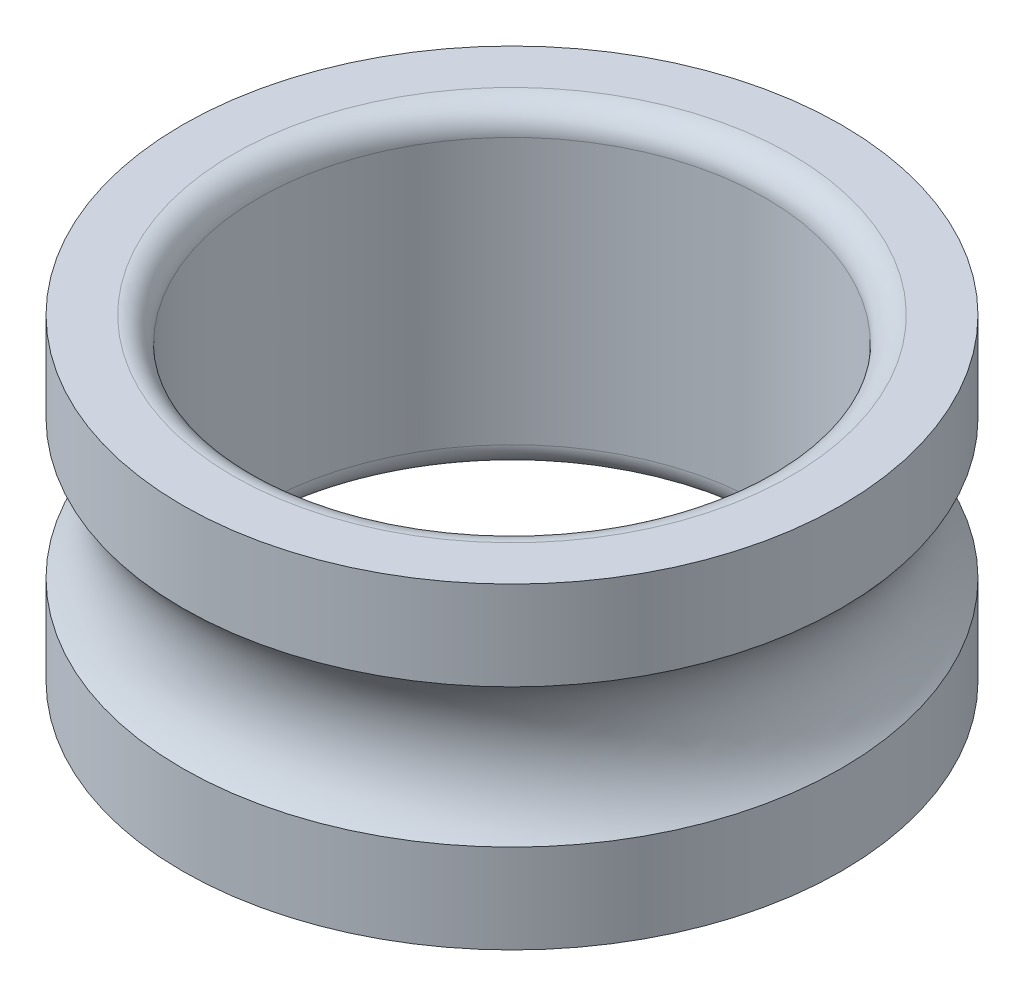
ISO-10303-21;
HEADER;
FILE_DESCRIPTION(('STEP AP214'),'2;1');
FILE_NAME('part.step','',(''),(''),'','','');
FILE_SCHEMA(('AUTOMOTIVE_DESIGN { 1 0 10303 214 1 1 1 1 }'));
ENDSEC;
DATA;
#1=APPLICATION_CONTEXT('core data for automotive mechanical design processes');
#2=APPLICATION_PROTOCOL_DEFINITION('international standard','automotive_design',2000,#1);
#3=PRODUCT_CONTEXT('',#1,'mechanical');
#4=PRODUCT('Part','Part','',(#3));
#5=PRODUCT_RELATED_PRODUCT_CATEGORY('part','',(#4));
#6=PRODUCT_DEFINITION_FORMATION('','',#4);
#7=PRODUCT_DEFINITION_CONTEXT('part definition',#1,'design');
#8=PRODUCT_DEFINITION('design','',#6,#7);
#9=PRODUCT_DEFINITION_SHAPE('','',#8);
#10=(LENGTH_UNIT() NAMED_UNIT(*) SI_UNIT(.MILLI.,.METRE.));
#11=(NAMED_UNIT(*) PLANE_ANGLE_UNIT() SI_UNIT($,.RADIAN.));
#12=(NAMED_UNIT(*) SI_UNIT($,.STERADIAN.) SOLID_ANGLE_UNIT());
#13=UNCERTAINTY_MEASURE_WITH_UNIT(LENGTH_MEASURE(1.E-05),#10,'distance_accuracy_value','');
#14=(GEOMETRIC_REPRESENTATION_CONTEXT(3) GLOBAL_UNCERTAINTY_ASSIGNED_CONTEXT((#13)) GLOBAL_UNIT_ASSIGNED_CONTEXT((#10,
#11,#12)) REPRESENTATION_CONTEXT('',''));
#15=CARTESIAN_POINT('',(0.,0.,0.));
#16=DIRECTION('',(0.,0.,1.));
#17=DIRECTION('',(1.,0.,0.));
#18=AXIS2_PLACEMENT_3D('',#15,#16,#17);
#19=CARTESIAN_POINT('',(0.,-1.25,0.));
#20=DIRECTION('',(0.,1.,0.));
#21=DIRECTION('',(1.,0.,0.));
#22=AXIS2_PLACEMENT_3D('',#19,#20,#21);
#23=PLANE('',#22);
#24=CARTESIAN_POINT('',(0.,-1.25,0.));
#25=DIRECTION('',(0.,1.,0.));
#26=DIRECTION('',(0.,0.,-1.));
#27=AXIS2_PLACEMENT_3D('',#24,#25,#26);
#28=CIRCLE('',#27,2.2);
#29=CARTESIAN_POINT('',(0.,-1.25,-2.2));
#30=VERTEX_POINT('',#29);
#31=EDGE_CURVE('E63',#30,#30,#28,.T.);
#32=ORIENTED_EDGE('',*,*,#31,.T.);
#33=EDGE_LOOP('',(#32));
#34=FACE_BOUND('',#33,.T.);
#35=CARTESIAN_POINT('',(0.,-1.25,0.));
#36=DIRECTION('',(0.,-1.,0.));
#37=DIRECTION('',(0.,0.,-1.));
#38=AXIS2_PLACEMENT_3D('',#35,#36,#37);
#39=CIRCLE('',#38,2.6);
#40=CARTESIAN_POINT('',(0.,-1.25,2.6));
#41=VERTEX_POINT('',#40);
#42=EDGE_CURVE('E11',#41,#41,#39,.T.);
#43=ORIENTED_EDGE('',*,*,#42,.T.);
#44=EDGE_LOOP('',(#43));
#45=FACE_BOUND('',#44,.T.);
#46=ADVANCED_FACE('F16',(#34,#45),#23,.F.);
#47=CARTESIAN_POINT('',(0.,-1.375,0.));
#48=DIRECTION('',(0.,1.,0.));
#49=DIRECTION('',(0.,0.,-1.));
#50=AXIS2_PLACEMENT_3D('',#47,#48,#49);
#51=CYLINDRICAL_SURFACE('',#50,2.6);
#52=CARTESIAN_POINT('',(0.,-0.5475499977171,0.));
#53=DIRECTION('',(0.,-1.,0.));
#54=DIRECTION('',(0.,0.,-1.));
#55=AXIS2_PLACEMENT_3D('',#52,#53,#54);
#56=CIRCLE('',#55,2.6);
#57=CARTESIAN_POINT('',(0.,-0.5475499977171,-2.6));
#58=VERTEX_POINT('',#57);
#59=EDGE_CURVE('E27',#58,#58,#56,.T.);
#60=ORIENTED_EDGE('',*,*,#59,.T.);
#61=EDGE_LOOP('',(#60));
#62=FACE_BOUND('',#61,.T.);
#63=ORIENTED_EDGE('',*,*,#42,.F.);
#64=EDGE_LOOP('',(#63));
#65=FACE_BOUND('',#64,.T.);
#66=ADVANCED_FACE('F112',(#62,#65),#51,.T.);
#67=CARTESIAN_POINT('',(0.,0.,0.));
#68=DIRECTION('',(0.,1.,0.));
#69=DIRECTION('',(0.,0.,-1.));
#70=AXIS2_PLACEMENT_3D('',#67,#68,#69);
#71=TOROIDAL_SURFACE('',#70,3.175,0.794);
#72=ORIENTED_EDGE('',*,*,#59,.F.);
#73=EDGE_LOOP('',(#72));
#74=FACE_BOUND('',#73,.T.);
#75=CARTESIAN_POINT('',(0.,0.5475499977171,0.));
#76=DIRECTION('',(0.,-1.,0.));
#77=DIRECTION('',(0.,0.,-1.));
#78=AXIS2_PLACEMENT_3D('',#75,#76,#77);
#79=CIRCLE('',#78,2.6);
#80=CARTESIAN_POINT('',(0.,0.5475499977171,2.6));
#81=VERTEX_POINT('',#80);
#82=EDGE_CURVE('E77',#81,#81,#79,.T.);
#83=ORIENTED_EDGE('',*,*,#82,.T.);
#84=EDGE_LOOP('',(#83));
#85=FACE_BOUND('',#84,.T.);
#86=ADVANCED_FACE('F18',(#74,#85),#71,.F.);
#87=CARTESIAN_POINT('',(0.,-1.375,0.));
#88=DIRECTION('',(0.,1.,0.));
#89=DIRECTION('',(0.,0.,-1.));
#90=AXIS2_PLACEMENT_3D('',#87,#88,#89);
#91=CYLINDRICAL_SURFACE('',#90,2.6);
#92=CARTESIAN_POINT('',(0.,1.25,0.));
#93=DIRECTION('',(0.,1.,0.));
#94=DIRECTION('',(0.,0.,-1.));
#95=AXIS2_PLACEMENT_3D('',#92,#93,#94);
#96=CIRCLE('',#95,2.6);
#97=CARTESIAN_POINT('',(0.,1.25,2.6));
#98=VERTEX_POINT('',#97);
#99=EDGE_CURVE('E71',#98,#98,#96,.T.);
#100=ORIENTED_EDGE('',*,*,#99,.F.);
#101=EDGE_LOOP('',(#100));
#102=FACE_BOUND('',#101,.T.);
#103=ORIENTED_EDGE('',*,*,#82,.F.);
#104=EDGE_LOOP('',(#103));
#105=FACE_BOUND('',#104,.T.);
#106=ADVANCED_FACE('F122',(#102,#105),#91,.T.);
#107=CARTESIAN_POINT('',(0.,1.25,0.));
#108=DIRECTION('',(0.,1.,0.));
#109=DIRECTION('',(1.,0.,0.));
#110=AXIS2_PLACEMENT_3D('',#107,#108,#109);
#111=PLANE('',#110);
#112=CARTESIAN_POINT('',(0.,1.25,0.));
#113=DIRECTION('',(0.,-1.,0.));
#114=DIRECTION('',(0.,0.,-1.));
#115=AXIS2_PLACEMENT_3D('',#112,#113,#114);
#116=CIRCLE('',#115,2.2);
#117=CARTESIAN_POINT('',(0.,1.25,2.2));
#118=VERTEX_POINT('',#117);
#119=EDGE_CURVE('E85',#118,#118,#116,.T.);
#120=ORIENTED_EDGE('',*,*,#119,.T.);
#121=EDGE_LOOP('',(#120));
#122=FACE_BOUND('',#121,.T.);
#123=ORIENTED_EDGE('',*,*,#99,.T.);
#124=EDGE_LOOP('',(#123));
#125=FACE_BOUND('',#124,.T.);
#126=ADVANCED_FACE('F121',(#122,#125),#111,.T.);
#127=CARTESIAN_POINT('',(0.,1.05,0.));
#128=DIRECTION('',(0.,1.,0.));
#129=DIRECTION('',(0.,0.,-1.));
#130=AXIS2_PLACEMENT_3D('',#127,#128,#129);
#131=TOROIDAL_SURFACE('',#130,2.2,0.2);
#132=CARTESIAN_POINT('',(0.,1.05,0.));
#133=DIRECTION('',(0.,-1.,0.));
#134=DIRECTION('',(0.,0.,-1.));
#135=AXIS2_PLACEMENT_3D('',#132,#133,#134);
#136=CIRCLE('',#135,2.);
#137=CARTESIAN_POINT('',(0.,1.05,-2.));
#138=VERTEX_POINT('',#137);
#139=EDGE_CURVE('E51',#138,#138,#136,.T.);
#140=ORIENTED_EDGE('',*,*,#139,.T.);
#141=EDGE_LOOP('',(#140));
#142=FACE_BOUND('',#141,.T.);
#143=ORIENTED_EDGE('',*,*,#119,.F.);
#144=EDGE_LOOP('',(#143));
#145=FACE_BOUND('',#144,.T.);
#146=ADVANCED_FACE('F107',(#142,#145),#131,.T.);
#147=CARTESIAN_POINT('',(0.,-1.375,0.));
#148=DIRECTION('',(0.,1.,0.));
#149=DIRECTION('',(0.,0.,-1.));
#150=AXIS2_PLACEMENT_3D('',#147,#148,#149);
#151=CYLINDRICAL_SURFACE('',#150,2.);
#152=ORIENTED_EDGE('',*,*,#139,.F.);
#153=EDGE_LOOP('',(#152));
#154=FACE_BOUND('',#153,.T.);
#155=CARTESIAN_POINT('',(0.,-1.05,0.));
#156=DIRECTION('',(0.,-1.,0.));
#157=DIRECTION('',(0.,0.,-1.));
#158=AXIS2_PLACEMENT_3D('',#155,#156,#157);
#159=CIRCLE('',#158,2.);
#160=CARTESIAN_POINT('',(0.,-1.05,2.));
#161=VERTEX_POINT('',#160);
#162=EDGE_CURVE('E20',#161,#161,#159,.T.);
#163=ORIENTED_EDGE('',*,*,#162,.T.);
#164=EDGE_LOOP('',(#163));
#165=FACE_BOUND('',#164,.T.);
#166=ADVANCED_FACE('F98',(#154,#165),#151,.F.);
#167=CARTESIAN_POINT('',(0.,-1.05,0.));
#168=DIRECTION('',(0.,1.,0.));
#169=DIRECTION('',(0.,0.,-1.));
#170=AXIS2_PLACEMENT_3D('',#167,#168,#169);
#171=TOROIDAL_SURFACE('',#170,2.2,0.2);
#172=ORIENTED_EDGE('',*,*,#31,.F.);
#173=EDGE_LOOP('',(#172));
#174=FACE_BOUND('',#173,.T.);
#175=ORIENTED_EDGE('',*,*,#162,.F.);
#176=EDGE_LOOP('',(#175));
#177=FACE_BOUND('',#176,.T.);
#178=ADVANCED_FACE('F100',(#174,#177),#171,.T.);
#179=CLOSED_SHELL('',(#46,#66,#86,#106,#126,#146,#166,#178));
#180=MANIFOLD_SOLID_BREP('B1',#179);
#181=ADVANCED_BREP_SHAPE_REPRESENTATION('',(#18,#180),#14);
#182=SHAPE_DEFINITION_REPRESENTATION(#9,#181);
ENDSEC;
END-ISO-10303-21;
